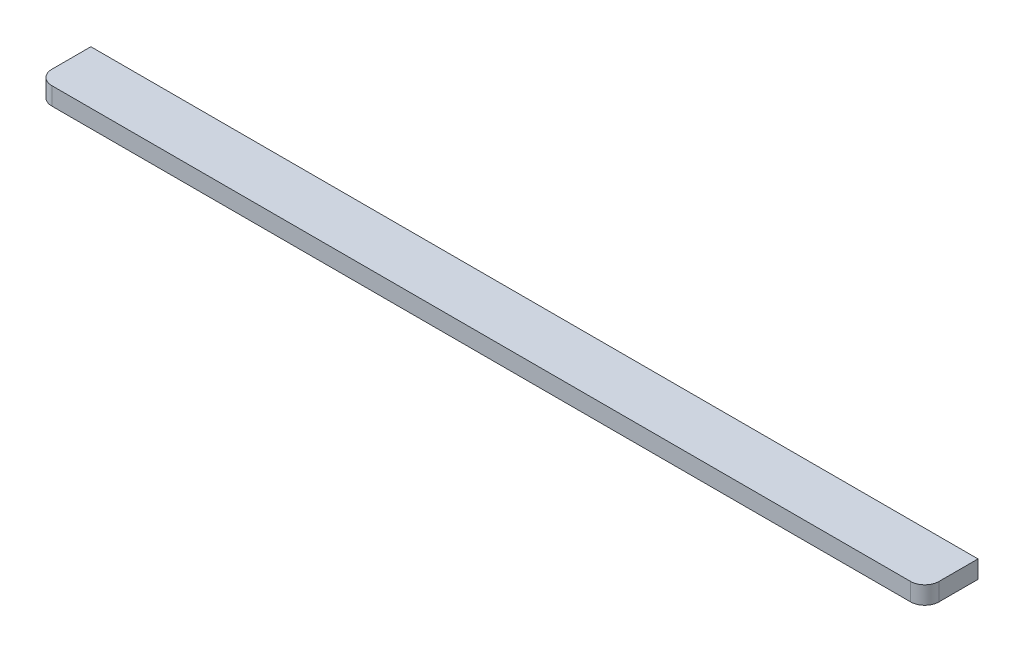
ISO-10303-21;
HEADER;
FILE_DESCRIPTION(('STEP AP214'),'2;1');
FILE_NAME('part.step','',(''),(''),'','','');
FILE_SCHEMA(('AUTOMOTIVE_DESIGN { 1 0 10303 214 1 1 1 1 }'));
ENDSEC;
DATA;
#1=APPLICATION_CONTEXT('core data for automotive mechanical design processes');
#2=APPLICATION_PROTOCOL_DEFINITION('international standard','automotive_design',2000,#1);
#3=PRODUCT_CONTEXT('',#1,'mechanical');
#4=PRODUCT('Part','Part','',(#3));
#5=PRODUCT_RELATED_PRODUCT_CATEGORY('part','',(#4));
#6=PRODUCT_DEFINITION_FORMATION('','',#4);
#7=PRODUCT_DEFINITION_CONTEXT('part definition',#1,'design');
#8=PRODUCT_DEFINITION('design','',#6,#7);
#9=PRODUCT_DEFINITION_SHAPE('','',#8);
#10=(LENGTH_UNIT() NAMED_UNIT(*) SI_UNIT(.MILLI.,.METRE.));
#11=(NAMED_UNIT(*) PLANE_ANGLE_UNIT() SI_UNIT($,.RADIAN.));
#12=(NAMED_UNIT(*) SI_UNIT($,.STERADIAN.) SOLID_ANGLE_UNIT());
#13=UNCERTAINTY_MEASURE_WITH_UNIT(LENGTH_MEASURE(1.E-05),#10,'distance_accuracy_value','');
#14=(GEOMETRIC_REPRESENTATION_CONTEXT(3) GLOBAL_UNCERTAINTY_ASSIGNED_CONTEXT((#13)) GLOBAL_UNIT_ASSIGNED_CONTEXT((#10,
#11,#12)) REPRESENTATION_CONTEXT('',''));
#15=CARTESIAN_POINT('',(0.,0.,0.));
#16=DIRECTION('',(0.,0.,1.));
#17=DIRECTION('',(1.,0.,0.));
#18=AXIS2_PLACEMENT_3D('',#15,#16,#17);
#19=CARTESIAN_POINT('',(250.,5.,-4.00000000000003));
#20=DIRECTION('',(-1.,0.,0.));
#21=DIRECTION('',(0.,0.,1.));
#22=AXIS2_PLACEMENT_3D('',#19,#20,#21);
#23=PLANE('',#22);
#24=DIRECTION('',(0.,0.,-1.));
#25=VECTOR('',#24,1.);
#26=CARTESIAN_POINT('',(250.,0.,-4.00000000000003));
#27=LINE('',#26,#25);
#28=CARTESIAN_POINT('',(250.,0.,-4.00000000000003));
#29=VERTEX_POINT('',#28);
#30=CARTESIAN_POINT('',(250.,0.,-15.));
#31=VERTEX_POINT('',#30);
#32=EDGE_CURVE('E119',#29,#31,#27,.T.);
#33=ORIENTED_EDGE('',*,*,#32,.T.);
#34=DIRECTION('',(0.,-1.,0.));
#35=VECTOR('',#34,1.);
#36=CARTESIAN_POINT('',(250.,5.,-15.));
#37=LINE('',#36,#35);
#38=CARTESIAN_POINT('',(250.,5.,-15.));
#39=VERTEX_POINT('',#38);
#40=EDGE_CURVE('E11',#39,#31,#37,.T.);
#41=ORIENTED_EDGE('',*,*,#40,.F.);
#42=DIRECTION('',(0.,0.,-1.));
#43=VECTOR('',#42,1.);
#44=CARTESIAN_POINT('',(250.,5.,-4.00000000000003));
#45=LINE('',#44,#43);
#46=CARTESIAN_POINT('',(250.,5.,-4.00000000000003));
#47=VERTEX_POINT('',#46);
#48=EDGE_CURVE('E129',#47,#39,#45,.T.);
#49=ORIENTED_EDGE('',*,*,#48,.F.);
#50=DIRECTION('',(0.,-1.,0.));
#51=VECTOR('',#50,1.);
#52=CARTESIAN_POINT('',(250.,5.,-4.00000000000003));
#53=LINE('',#52,#51);
#54=EDGE_CURVE('E115',#47,#29,#53,.T.);
#55=ORIENTED_EDGE('',*,*,#54,.T.);
#56=EDGE_LOOP('',(#33,#41,#49,#55));
#57=FACE_BOUND('',#56,.T.);
#58=ADVANCED_FACE('F35',(#57),#23,.F.);
#59=CARTESIAN_POINT('',(0.,5.,-15.));
#60=DIRECTION('',(0.,0.,1.));
#61=DIRECTION('',(1.,0.,0.));
#62=AXIS2_PLACEMENT_3D('',#59,#60,#61);
#63=PLANE('',#62);
#64=DIRECTION('',(-1.,0.,0.));
#65=VECTOR('',#64,1.);
#66=CARTESIAN_POINT('',(0.,0.,-15.));
#67=LINE('',#66,#65);
#68=CARTESIAN_POINT('',(0.,0.,-15.));
#69=VERTEX_POINT('',#68);
#70=EDGE_CURVE('E122',#31,#69,#67,.T.);
#71=ORIENTED_EDGE('',*,*,#70,.T.);
#72=DIRECTION('',(0.,-1.,0.));
#73=VECTOR('',#72,1.);
#74=CARTESIAN_POINT('',(0.,5.,-15.));
#75=LINE('',#74,#73);
#76=CARTESIAN_POINT('',(0.,5.,-15.));
#77=VERTEX_POINT('',#76);
#78=EDGE_CURVE('E43',#77,#69,#75,.T.);
#79=ORIENTED_EDGE('',*,*,#78,.F.);
#80=DIRECTION('',(-1.,0.,0.));
#81=VECTOR('',#80,1.);
#82=CARTESIAN_POINT('',(0.,5.,-15.));
#83=LINE('',#82,#81);
#84=EDGE_CURVE('E88',#39,#77,#83,.T.);
#85=ORIENTED_EDGE('',*,*,#84,.F.);
#86=ORIENTED_EDGE('',*,*,#40,.T.);
#87=EDGE_LOOP('',(#71,#79,#85,#86));
#88=FACE_BOUND('',#87,.T.);
#89=ADVANCED_FACE('F153',(#88),#63,.F.);
#90=CARTESIAN_POINT('',(0.,5.,-4.00000000000003));
#91=DIRECTION('',(1.,0.,0.));
#92=DIRECTION('',(0.,0.,-1.));
#93=AXIS2_PLACEMENT_3D('',#90,#91,#92);
#94=PLANE('',#93);
#95=DIRECTION('',(0.,0.,1.));
#96=VECTOR('',#95,1.);
#97=CARTESIAN_POINT('',(0.,0.,-4.00000000000003));
#98=LINE('',#97,#96);
#99=CARTESIAN_POINT('',(0.,0.,-4.00000000000003));
#100=VERTEX_POINT('',#99);
#101=EDGE_CURVE('E124',#69,#100,#98,.T.);
#102=ORIENTED_EDGE('',*,*,#101,.T.);
#103=DIRECTION('',(0.,-1.,0.));
#104=VECTOR('',#103,1.);
#105=CARTESIAN_POINT('',(0.,5.,-4.00000000000003));
#106=LINE('',#105,#104);
#107=CARTESIAN_POINT('',(0.,5.,-4.00000000000003));
#108=VERTEX_POINT('',#107);
#109=EDGE_CURVE('E110',#108,#100,#106,.T.);
#110=ORIENTED_EDGE('',*,*,#109,.F.);
#111=DIRECTION('',(0.,0.,1.));
#112=VECTOR('',#111,1.);
#113=CARTESIAN_POINT('',(0.,5.,-4.00000000000003));
#114=LINE('',#113,#112);
#115=EDGE_CURVE('E101',#77,#108,#114,.T.);
#116=ORIENTED_EDGE('',*,*,#115,.F.);
#117=ORIENTED_EDGE('',*,*,#78,.T.);
#118=EDGE_LOOP('',(#102,#110,#116,#117));
#119=FACE_BOUND('',#118,.T.);
#120=ADVANCED_FACE('F135',(#119),#94,.F.);
#121=CARTESIAN_POINT('',(4.,5.,-4.));
#122=DIRECTION('',(0.,-1.,0.));
#123=DIRECTION('',(0.,0.,-1.));
#124=AXIS2_PLACEMENT_3D('',#121,#122,#123);
#125=CYLINDRICAL_SURFACE('',#124,4.);
#126=CARTESIAN_POINT('',(4.,0.,-4.));
#127=DIRECTION('',(0.,1.,0.));
#128=DIRECTION('',(0.,0.,-1.));
#129=AXIS2_PLACEMENT_3D('',#126,#127,#128);
#130=CIRCLE('',#129,4.);
#131=CARTESIAN_POINT('',(4.00000000000003,0.,0.));
#132=VERTEX_POINT('',#131);
#133=EDGE_CURVE('E109',#100,#132,#130,.T.);
#134=ORIENTED_EDGE('',*,*,#133,.T.);
#135=DIRECTION('',(0.,-1.,0.));
#136=VECTOR('',#135,1.);
#137=CARTESIAN_POINT('',(4.00000000000003,5.,0.));
#138=LINE('',#137,#136);
#139=CARTESIAN_POINT('',(4.00000000000003,5.,0.));
#140=VERTEX_POINT('',#139);
#141=EDGE_CURVE('E106',#140,#132,#138,.T.);
#142=ORIENTED_EDGE('',*,*,#141,.F.);
#143=CARTESIAN_POINT('',(4.,5.,-4.));
#144=DIRECTION('',(0.,1.,0.));
#145=DIRECTION('',(0.,0.,-1.));
#146=AXIS2_PLACEMENT_3D('',#143,#144,#145);
#147=CIRCLE('',#146,4.);
#148=EDGE_CURVE('E95',#108,#140,#147,.T.);
#149=ORIENTED_EDGE('',*,*,#148,.F.);
#150=ORIENTED_EDGE('',*,*,#109,.T.);
#151=EDGE_LOOP('',(#134,#142,#149,#150));
#152=FACE_BOUND('',#151,.T.);
#153=ADVANCED_FACE('F107',(#152),#125,.T.);
#154=CARTESIAN_POINT('',(4.00000000000003,5.,0.));
#155=DIRECTION('',(0.,0.,-1.));
#156=DIRECTION('',(-1.,0.,0.));
#157=AXIS2_PLACEMENT_3D('',#154,#155,#156);
#158=PLANE('',#157);
#159=DIRECTION('',(1.,0.,0.));
#160=VECTOR('',#159,1.);
#161=CARTESIAN_POINT('',(4.00000000000003,0.,0.));
#162=LINE('',#161,#160);
#163=CARTESIAN_POINT('',(246.,0.,0.));
#164=VERTEX_POINT('',#163);
#165=EDGE_CURVE('E74',#132,#164,#162,.T.);
#166=ORIENTED_EDGE('',*,*,#165,.T.);
#167=DIRECTION('',(0.,-1.,0.));
#168=VECTOR('',#167,1.);
#169=CARTESIAN_POINT('',(246.,5.,0.));
#170=LINE('',#169,#168);
#171=CARTESIAN_POINT('',(246.,5.,0.));
#172=VERTEX_POINT('',#171);
#173=EDGE_CURVE('E111',#172,#164,#170,.T.);
#174=ORIENTED_EDGE('',*,*,#173,.F.);
#175=DIRECTION('',(1.,0.,0.));
#176=VECTOR('',#175,1.);
#177=CARTESIAN_POINT('',(4.00000000000003,5.,0.));
#178=LINE('',#177,#176);
#179=EDGE_CURVE('E99',#140,#172,#178,.T.);
#180=ORIENTED_EDGE('',*,*,#179,.F.);
#181=ORIENTED_EDGE('',*,*,#141,.T.);
#182=EDGE_LOOP('',(#166,#174,#180,#181));
#183=FACE_BOUND('',#182,.T.);
#184=ADVANCED_FACE('F113',(#183),#158,.F.);
#185=CARTESIAN_POINT('',(246.,5.,-4.));
#186=DIRECTION('',(0.,-1.,0.));
#187=DIRECTION('',(0.,0.,-1.));
#188=AXIS2_PLACEMENT_3D('',#185,#186,#187);
#189=CYLINDRICAL_SURFACE('',#188,4.);
#190=CARTESIAN_POINT('',(246.,0.,-4.));
#191=DIRECTION('',(0.,1.,0.));
#192=DIRECTION('',(0.,0.,1.));
#193=AXIS2_PLACEMENT_3D('',#190,#191,#192);
#194=CIRCLE('',#193,4.);
#195=EDGE_CURVE('E80',#164,#29,#194,.T.);
#196=ORIENTED_EDGE('',*,*,#195,.T.);
#197=ORIENTED_EDGE('',*,*,#54,.F.);
#198=CARTESIAN_POINT('',(246.,5.,-4.));
#199=DIRECTION('',(0.,1.,0.));
#200=DIRECTION('',(0.,0.,1.));
#201=AXIS2_PLACEMENT_3D('',#198,#199,#200);
#202=CIRCLE('',#201,4.);
#203=EDGE_CURVE('E51',#172,#47,#202,.T.);
#204=ORIENTED_EDGE('',*,*,#203,.F.);
#205=ORIENTED_EDGE('',*,*,#173,.T.);
#206=EDGE_LOOP('',(#196,#197,#204,#205));
#207=FACE_BOUND('',#206,.T.);
#208=ADVANCED_FACE('F142',(#207),#189,.T.);
#209=CARTESIAN_POINT('',(4.,5.,-4.));
#210=DIRECTION('',(0.,-1.,0.));
#211=DIRECTION('',(0.,0.,-1.));
#212=AXIS2_PLACEMENT_3D('',#209,#210,#211);
#213=PLANE('',#212);
#214=ORIENTED_EDGE('',*,*,#48,.T.);
#215=ORIENTED_EDGE('',*,*,#84,.T.);
#216=ORIENTED_EDGE('',*,*,#115,.T.);
#217=ORIENTED_EDGE('',*,*,#148,.T.);
#218=ORIENTED_EDGE('',*,*,#179,.T.);
#219=ORIENTED_EDGE('',*,*,#203,.T.);
#220=EDGE_LOOP('',(#214,#215,#216,#217,#218,#219));
#221=FACE_BOUND('',#220,.T.);
#222=ADVANCED_FACE('F97',(#221),#213,.F.);
#223=CARTESIAN_POINT('',(4.,0.,-4.));
#224=DIRECTION('',(0.,-1.,0.));
#225=DIRECTION('',(0.,0.,-1.));
#226=AXIS2_PLACEMENT_3D('',#223,#224,#225);
#227=PLANE('',#226);
#228=ORIENTED_EDGE('',*,*,#32,.F.);
#229=ORIENTED_EDGE('',*,*,#195,.F.);
#230=ORIENTED_EDGE('',*,*,#165,.F.);
#231=ORIENTED_EDGE('',*,*,#133,.F.);
#232=ORIENTED_EDGE('',*,*,#101,.F.);
#233=ORIENTED_EDGE('',*,*,#70,.F.);
#234=EDGE_LOOP('',(#228,#229,#230,#231,#232,#233));
#235=FACE_BOUND('',#234,.T.);
#236=ADVANCED_FACE('F138',(#235),#227,.T.);
#237=CLOSED_SHELL('',(#58,#89,#120,#153,#184,#208,#222,#236));
#238=MANIFOLD_SOLID_BREP('B2',#237);
#239=ADVANCED_BREP_SHAPE_REPRESENTATION('',(#18,#238),#14);
#240=SHAPE_DEFINITION_REPRESENTATION(#9,#239);
ENDSEC;
END-ISO-10303-21;
